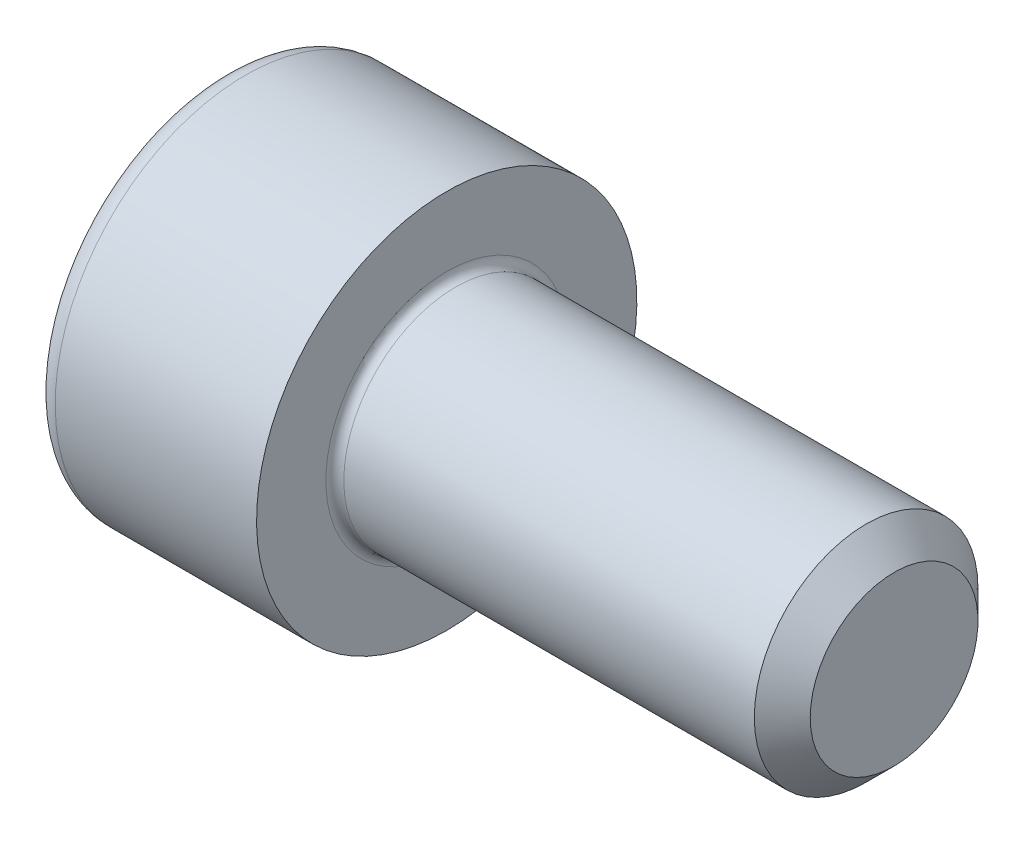
ISO-10303-21;
HEADER;
FILE_DESCRIPTION(('STEP AP214'),'2;1');
FILE_NAME('part.step','',(''),(''),'','','');
FILE_SCHEMA(('AUTOMOTIVE_DESIGN { 1 0 10303 214 1 1 1 1 }'));
ENDSEC;
DATA;
#1=APPLICATION_CONTEXT('core data for automotive mechanical design processes');
#2=APPLICATION_PROTOCOL_DEFINITION('international standard','automotive_design',2000,#1);
#3=PRODUCT_CONTEXT('',#1,'mechanical');
#4=PRODUCT('Part','Part','',(#3));
#5=PRODUCT_RELATED_PRODUCT_CATEGORY('part','',(#4));
#6=PRODUCT_DEFINITION_FORMATION('','',#4);
#7=PRODUCT_DEFINITION_CONTEXT('part definition',#1,'design');
#8=PRODUCT_DEFINITION('design','',#6,#7);
#9=PRODUCT_DEFINITION_SHAPE('','',#8);
#10=(LENGTH_UNIT() NAMED_UNIT(*) SI_UNIT(.MILLI.,.METRE.));
#11=(NAMED_UNIT(*) PLANE_ANGLE_UNIT() SI_UNIT($,.RADIAN.));
#12=(NAMED_UNIT(*) SI_UNIT($,.STERADIAN.) SOLID_ANGLE_UNIT());
#13=UNCERTAINTY_MEASURE_WITH_UNIT(LENGTH_MEASURE(1.E-05),#10,'distance_accuracy_value','');
#14=(GEOMETRIC_REPRESENTATION_CONTEXT(3) GLOBAL_UNCERTAINTY_ASSIGNED_CONTEXT((#13)) GLOBAL_UNIT_ASSIGNED_CONTEXT((#10,
#11,#12)) REPRESENTATION_CONTEXT('',''));
#15=CARTESIAN_POINT('',(0.,0.,0.));
#16=DIRECTION('',(0.,0.,1.));
#17=DIRECTION('',(1.,0.,0.));
#18=AXIS2_PLACEMENT_3D('',#15,#16,#17);
#19=CARTESIAN_POINT('',(-1.99999999995271,0.,0.));
#20=DIRECTION('',(-1.,0.,0.));
#21=DIRECTION('',(0.,0.,1.));
#22=AXIS2_PLACEMENT_3D('',#19,#20,#21);
#23=CONICAL_SURFACE('',#22,1.83319999985088,1.04719755109013);
#24=CARTESIAN_POINT('',(-0.941601486488253,-1.13686837721616E-10,0.));
#25=VERTEX_POINT('',#24);
#26=VERTEX_LOOP('',#25);
#27=FACE_BOUND('',#26,.T.);
#28=CARTESIAN_POINT('',(-2.00000000001834,0.,0.));
#29=DIRECTION('',(-1.,0.,0.));
#30=DIRECTION('',(0.,0.,1.));
#31=AXIS2_PLACEMENT_3D('',#28,#29,#30);
#32=CIRCLE('',#31,1.83319999996456);
#33=CARTESIAN_POINT('',(-2.00000000001834,-0.916599999982282,-1.58759777018694));
#34=VERTEX_POINT('',#33);
#35=CARTESIAN_POINT('',(-2.00000000001834,-1.83319999996456,0.));
#36=VERTEX_POINT('',#35);
#37=EDGE_CURVE('E88',#34,#36,#32,.T.);
#38=ORIENTED_EDGE('',*,*,#37,.T.);
#39=CARTESIAN_POINT('',(-2.00000000001834,0.,0.));
#40=DIRECTION('',(-1.,0.,0.));
#41=DIRECTION('',(0.,0.,1.));
#42=AXIS2_PLACEMENT_3D('',#39,#40,#41);
#43=CIRCLE('',#42,1.83319999996456);
#44=CARTESIAN_POINT('',(-2.00000000001834,-0.916599999982281,1.58759777018694));
#45=VERTEX_POINT('',#44);
#46=EDGE_CURVE('E83',#36,#45,#43,.T.);
#47=ORIENTED_EDGE('',*,*,#46,.T.);
#48=CARTESIAN_POINT('',(-2.00000000001834,0.,0.));
#49=DIRECTION('',(-1.,0.,0.));
#50=DIRECTION('',(0.,0.,1.));
#51=AXIS2_PLACEMENT_3D('',#48,#49,#50);
#52=CIRCLE('',#51,1.83319999996456);
#53=CARTESIAN_POINT('',(-1.99999999995271,0.916599999925436,1.58759777008849));
#54=VERTEX_POINT('',#53);
#55=EDGE_CURVE('E85',#45,#54,#52,.T.);
#56=ORIENTED_EDGE('',*,*,#55,.T.);
#57=CARTESIAN_POINT('',(-1.99999999995271,0.,0.));
#58=DIRECTION('',(-1.,0.,0.));
#59=DIRECTION('',(0.,0.,1.));
#60=AXIS2_PLACEMENT_3D('',#57,#58,#59);
#61=CIRCLE('',#60,1.83319999985088);
#62=CARTESIAN_POINT('',(-1.99999999995271,1.83319999985088,0.));
#63=VERTEX_POINT('',#62);
#64=EDGE_CURVE('E99',#54,#63,#61,.T.);
#65=ORIENTED_EDGE('',*,*,#64,.T.);
#66=CARTESIAN_POINT('',(-2.00000000001834,0.,0.));
#67=DIRECTION('',(-1.,0.,0.));
#68=DIRECTION('',(0.,0.,1.));
#69=AXIS2_PLACEMENT_3D('',#66,#67,#68);
#70=CIRCLE('',#69,1.83319999996456);
#71=CARTESIAN_POINT('',(-2.00000000001834,0.91659999998228,-1.58759777018694));
#72=VERTEX_POINT('',#71);
#73=EDGE_CURVE('E186',#63,#72,#70,.T.);
#74=ORIENTED_EDGE('',*,*,#73,.T.);
#75=CARTESIAN_POINT('',(-2.00000000001834,0.,0.));
#76=DIRECTION('',(-1.,0.,0.));
#77=DIRECTION('',(0.,0.,1.));
#78=AXIS2_PLACEMENT_3D('',#75,#76,#77);
#79=CIRCLE('',#78,1.83319999996456);
#80=EDGE_CURVE('E184',#72,#34,#79,.T.);
#81=ORIENTED_EDGE('',*,*,#80,.T.);
#82=EDGE_LOOP('',(#38,#47,#56,#65,#74,#81));
#83=FACE_BOUND('',#82,.T.);
#84=ADVANCED_FACE('F16',(#27,#83),#23,.F.);
#85=CARTESIAN_POINT('',(-2.,0.,0.));
#86=DIRECTION('',(-1.,0.,0.));
#87=DIRECTION('',(0.,-1.,0.));
#88=AXIS2_PLACEMENT_3D('',#85,#86,#87);
#89=PLANE('',#88);
#90=ORIENTED_EDGE('',*,*,#55,.F.);
#91=DIRECTION('',(0.,-1.,0.));
#92=VECTOR('',#91,1.);
#93=CARTESIAN_POINT('',(-2.,-0.9166,1.58759777021763));
#94=LINE('',#93,#92);
#95=EDGE_CURVE('E93',#45,#54,#94,.F.);
#96=ORIENTED_EDGE('',*,*,#95,.T.);
#97=EDGE_LOOP('',(#90,#96));
#98=FACE_BOUND('',#97,.T.);
#99=ADVANCED_FACE('F96',(#98),#89,.F.);
#100=CARTESIAN_POINT('',(-2.,0.,0.));
#101=DIRECTION('',(-1.,0.,0.));
#102=DIRECTION('',(0.,-1.,0.));
#103=AXIS2_PLACEMENT_3D('',#100,#101,#102);
#104=PLANE('',#103);
#105=ORIENTED_EDGE('',*,*,#64,.F.);
#106=DIRECTION('',(0.,-0.5,0.866025403784439));
#107=VECTOR('',#106,1.);
#108=CARTESIAN_POINT('',(-2.,0.9166,1.58759777021763));
#109=LINE('',#108,#107);
#110=EDGE_CURVE('E162',#54,#63,#109,.F.);
#111=ORIENTED_EDGE('',*,*,#110,.T.);
#112=EDGE_LOOP('',(#105,#111));
#113=FACE_BOUND('',#112,.T.);
#114=ADVANCED_FACE('F293',(#113),#104,.F.);
#115=CARTESIAN_POINT('',(-2.,0.,0.));
#116=DIRECTION('',(-1.,0.,0.));
#117=DIRECTION('',(0.,-1.,0.));
#118=AXIS2_PLACEMENT_3D('',#115,#116,#117);
#119=PLANE('',#118);
#120=ORIENTED_EDGE('',*,*,#73,.F.);
#121=DIRECTION('',(0.,0.5,0.866025403784439));
#122=VECTOR('',#121,1.);
#123=CARTESIAN_POINT('',(-2.,1.8332,0.));
#124=LINE('',#123,#122);
#125=EDGE_CURVE('E151',#63,#72,#124,.F.);
#126=ORIENTED_EDGE('',*,*,#125,.T.);
#127=EDGE_LOOP('',(#120,#126));
#128=FACE_BOUND('',#127,.T.);
#129=ADVANCED_FACE('F297',(#128),#119,.F.);
#130=CARTESIAN_POINT('',(-2.,0.,0.));
#131=DIRECTION('',(-1.,0.,0.));
#132=DIRECTION('',(0.,-1.,0.));
#133=AXIS2_PLACEMENT_3D('',#130,#131,#132);
#134=PLANE('',#133);
#135=ORIENTED_EDGE('',*,*,#80,.F.);
#136=DIRECTION('',(0.,1.,0.));
#137=VECTOR('',#136,1.);
#138=CARTESIAN_POINT('',(-2.,0.9166,-1.58759777021763));
#139=LINE('',#138,#137);
#140=EDGE_CURVE('E139',#72,#34,#139,.F.);
#141=ORIENTED_EDGE('',*,*,#140,.T.);
#142=EDGE_LOOP('',(#135,#141));
#143=FACE_BOUND('',#142,.T.);
#144=ADVANCED_FACE('F304',(#143),#134,.F.);
#145=CARTESIAN_POINT('',(-2.,0.,0.));
#146=DIRECTION('',(-1.,0.,0.));
#147=DIRECTION('',(0.,-1.,0.));
#148=AXIS2_PLACEMENT_3D('',#145,#146,#147);
#149=PLANE('',#148);
#150=ORIENTED_EDGE('',*,*,#37,.F.);
#151=DIRECTION('',(0.,0.5,-0.866025403784438));
#152=VECTOR('',#151,1.);
#153=CARTESIAN_POINT('',(-2.,-0.9166,-1.58759777021763));
#154=LINE('',#153,#152);
#155=EDGE_CURVE('E125',#34,#36,#154,.F.);
#156=ORIENTED_EDGE('',*,*,#155,.T.);
#157=EDGE_LOOP('',(#150,#156));
#158=FACE_BOUND('',#157,.T.);
#159=ADVANCED_FACE('F307',(#158),#149,.F.);
#160=CARTESIAN_POINT('',(-2.,0.,0.));
#161=DIRECTION('',(-1.,0.,0.));
#162=DIRECTION('',(0.,-1.,0.));
#163=AXIS2_PLACEMENT_3D('',#160,#161,#162);
#164=PLANE('',#163);
#165=ORIENTED_EDGE('',*,*,#46,.F.);
#166=DIRECTION('',(0.,-0.5,-0.866025403784438));
#167=VECTOR('',#166,1.);
#168=CARTESIAN_POINT('',(-2.,-1.8332,0.));
#169=LINE('',#168,#167);
#170=EDGE_CURVE('E101',#36,#45,#169,.F.);
#171=ORIENTED_EDGE('',*,*,#170,.T.);
#172=EDGE_LOOP('',(#165,#171));
#173=FACE_BOUND('',#172,.T.);
#174=ADVANCED_FACE('F102',(#173),#164,.F.);
#175=CARTESIAN_POINT('',(-2.,-0.9166,1.58759777021763));
#176=DIRECTION('',(0.,0.,1.));
#177=DIRECTION('',(0.,-1.,0.));
#178=AXIS2_PLACEMENT_3D('',#175,#176,#177);
#179=PLANE('',#178);
#180=DIRECTION('',(1.,0.,0.));
#181=VECTOR('',#180,1.);
#182=CARTESIAN_POINT('',(-2.,0.9166,1.58759777021763));
#183=LINE('',#182,#181);
#184=CARTESIAN_POINT('',(-4.,0.916599999999999,1.58759777021763));
#185=VERTEX_POINT('',#184);
#186=EDGE_CURVE('E113',#185,#54,#183,.T.);
#187=ORIENTED_EDGE('',*,*,#186,.T.);
#188=ORIENTED_EDGE('',*,*,#95,.F.);
#189=DIRECTION('',(1.,0.,0.));
#190=VECTOR('',#189,1.);
#191=CARTESIAN_POINT('',(-2.,-0.9166,1.58759777021763));
#192=LINE('',#191,#190);
#193=CARTESIAN_POINT('',(-4.,-0.9166,1.58759777021763));
#194=VERTEX_POINT('',#193);
#195=EDGE_CURVE('E106',#45,#194,#192,.F.);
#196=ORIENTED_EDGE('',*,*,#195,.T.);
#197=DIRECTION('',(0.,1.,0.));
#198=VECTOR('',#197,1.);
#199=CARTESIAN_POINT('',(-4.,1.8332,1.58759777021763));
#200=LINE('',#199,#198);
#201=EDGE_CURVE('E120',#194,#185,#200,.T.);
#202=ORIENTED_EDGE('',*,*,#201,.T.);
#203=EDGE_LOOP('',(#187,#188,#196,#202));
#204=FACE_BOUND('',#203,.T.);
#205=ADVANCED_FACE('F110',(#204),#179,.F.);
#206=CARTESIAN_POINT('',(-2.,0.9166,1.58759777021763));
#207=DIRECTION('',(0.,0.866025403784439,0.5));
#208=DIRECTION('',(0.,-0.5,0.866025403784439));
#209=AXIS2_PLACEMENT_3D('',#206,#207,#208);
#210=PLANE('',#209);
#211=DIRECTION('',(1.,0.,0.));
#212=VECTOR('',#211,1.);
#213=CARTESIAN_POINT('',(-2.,1.8332,0.));
#214=LINE('',#213,#212);
#215=CARTESIAN_POINT('',(-4.,1.8332,0.));
#216=VERTEX_POINT('',#215);
#217=EDGE_CURVE('E156',#216,#63,#214,.T.);
#218=ORIENTED_EDGE('',*,*,#217,.T.);
#219=ORIENTED_EDGE('',*,*,#110,.F.);
#220=ORIENTED_EDGE('',*,*,#186,.F.);
#221=DIRECTION('',(0.,0.500000000000001,-0.866025403784438));
#222=VECTOR('',#221,1.);
#223=CARTESIAN_POINT('',(-4.,0.9166,1.58759777021763));
#224=LINE('',#223,#222);
#225=EDGE_CURVE('E122',#185,#216,#224,.T.);
#226=ORIENTED_EDGE('',*,*,#225,.T.);
#227=EDGE_LOOP('',(#218,#219,#220,#226));
#228=FACE_BOUND('',#227,.T.);
#229=ADVANCED_FACE('F289',(#228),#210,.F.);
#230=CARTESIAN_POINT('',(-2.,1.8332,0.));
#231=DIRECTION('',(0.,0.866025403784439,-0.5));
#232=DIRECTION('',(0.,0.5,0.866025403784439));
#233=AXIS2_PLACEMENT_3D('',#230,#231,#232);
#234=PLANE('',#233);
#235=DIRECTION('',(1.,0.,0.));
#236=VECTOR('',#235,1.);
#237=CARTESIAN_POINT('',(-2.,0.9166,-1.58759777021763));
#238=LINE('',#237,#236);
#239=CARTESIAN_POINT('',(-4.,0.9166,-1.58759777021763));
#240=VERTEX_POINT('',#239);
#241=EDGE_CURVE('E144',#240,#72,#238,.T.);
#242=ORIENTED_EDGE('',*,*,#241,.T.);
#243=ORIENTED_EDGE('',*,*,#125,.F.);
#244=ORIENTED_EDGE('',*,*,#217,.F.);
#245=DIRECTION('',(0.,-0.499999999999999,-0.866025403784439));
#246=VECTOR('',#245,1.);
#247=CARTESIAN_POINT('',(-4.,1.8332,0.));
#248=LINE('',#247,#246);
#249=EDGE_CURVE('E146',#216,#240,#248,.T.);
#250=ORIENTED_EDGE('',*,*,#249,.T.);
#251=EDGE_LOOP('',(#242,#243,#244,#250));
#252=FACE_BOUND('',#251,.T.);
#253=ADVANCED_FACE('F300',(#252),#234,.F.);
#254=CARTESIAN_POINT('',(-2.,0.9166,-1.58759777021763));
#255=DIRECTION('',(0.,0.,-1.));
#256=DIRECTION('',(0.,1.,0.));
#257=AXIS2_PLACEMENT_3D('',#254,#255,#256);
#258=PLANE('',#257);
#259=DIRECTION('',(1.,0.,0.));
#260=VECTOR('',#259,1.);
#261=CARTESIAN_POINT('',(-2.,-0.9166,-1.58759777021763));
#262=LINE('',#261,#260);
#263=CARTESIAN_POINT('',(-4.,-0.9166,-1.58759777021763));
#264=VERTEX_POINT('',#263);
#265=EDGE_CURVE('E127',#264,#34,#262,.T.);
#266=ORIENTED_EDGE('',*,*,#265,.T.);
#267=ORIENTED_EDGE('',*,*,#140,.F.);
#268=ORIENTED_EDGE('',*,*,#241,.F.);
#269=DIRECTION('',(0.,1.,0.));
#270=VECTOR('',#269,1.);
#271=CARTESIAN_POINT('',(-4.,1.8332,-1.58759777021763));
#272=LINE('',#271,#270);
#273=EDGE_CURVE('E130',#240,#264,#272,.F.);
#274=ORIENTED_EDGE('',*,*,#273,.T.);
#275=EDGE_LOOP('',(#266,#267,#268,#274));
#276=FACE_BOUND('',#275,.T.);
#277=ADVANCED_FACE('F305',(#276),#258,.F.);
#278=CARTESIAN_POINT('',(-2.,-0.9166,-1.58759777021763));
#279=DIRECTION('',(0.,-0.866025403784438,-0.5));
#280=DIRECTION('',(0.,0.5,-0.866025403784438));
#281=AXIS2_PLACEMENT_3D('',#278,#279,#280);
#282=PLANE('',#281);
#283=DIRECTION('',(1.,0.,0.));
#284=VECTOR('',#283,1.);
#285=CARTESIAN_POINT('',(-2.,-1.8332,0.));
#286=LINE('',#285,#284);
#287=CARTESIAN_POINT('',(-4.,-1.8332,0.));
#288=VERTEX_POINT('',#287);
#289=EDGE_CURVE('E107',#288,#36,#286,.T.);
#290=ORIENTED_EDGE('',*,*,#289,.T.);
#291=ORIENTED_EDGE('',*,*,#155,.F.);
#292=ORIENTED_EDGE('',*,*,#265,.F.);
#293=DIRECTION('',(0.,-0.5,0.866025403784439));
#294=VECTOR('',#293,1.);
#295=CARTESIAN_POINT('',(-4.,-0.9166,-1.58759777021763));
#296=LINE('',#295,#294);
#297=EDGE_CURVE('E128',#264,#288,#296,.T.);
#298=ORIENTED_EDGE('',*,*,#297,.T.);
#299=EDGE_LOOP('',(#290,#291,#292,#298));
#300=FACE_BOUND('',#299,.T.);
#301=ADVANCED_FACE('F280',(#300),#282,.F.);
#302=CARTESIAN_POINT('',(-2.,-1.8332,0.));
#303=DIRECTION('',(0.,-0.866025403784438,0.5));
#304=DIRECTION('',(0.,-0.5,-0.866025403784438));
#305=AXIS2_PLACEMENT_3D('',#302,#303,#304);
#306=PLANE('',#305);
#307=ORIENTED_EDGE('',*,*,#195,.F.);
#308=ORIENTED_EDGE('',*,*,#170,.F.);
#309=ORIENTED_EDGE('',*,*,#289,.F.);
#310=DIRECTION('',(0.,0.5,0.866025403784439));
#311=VECTOR('',#310,1.);
#312=CARTESIAN_POINT('',(-4.,-1.8332,0.));
#313=LINE('',#312,#311);
#314=EDGE_CURVE('E118',#288,#194,#313,.T.);
#315=ORIENTED_EDGE('',*,*,#314,.T.);
#316=EDGE_LOOP('',(#307,#308,#309,#315));
#317=FACE_BOUND('',#316,.T.);
#318=ADVANCED_FACE('F116',(#317),#306,.F.);
#319=CARTESIAN_POINT('',(-4.,1.8332,0.));
#320=DIRECTION('',(1.,0.,0.));
#321=DIRECTION('',(0.,1.,0.));
#322=AXIS2_PLACEMENT_3D('',#319,#320,#321);
#323=PLANE('',#322);
#324=CARTESIAN_POINT('',(-4.,0.,0.));
#325=DIRECTION('',(1.,0.,0.));
#326=DIRECTION('',(0.,-1.,0.));
#327=AXIS2_PLACEMENT_3D('',#324,#325,#326);
#328=CIRCLE('',#327,3.);
#329=CARTESIAN_POINT('',(-4.,-3.,0.));
#330=VERTEX_POINT('',#329);
#331=CARTESIAN_POINT('',(-4.,3.,0.));
#332=VERTEX_POINT('',#331);
#333=EDGE_CURVE('E134',#330,#332,#328,.T.);
#334=ORIENTED_EDGE('',*,*,#333,.F.);
#335=CARTESIAN_POINT('',(-4.,0.,0.));
#336=DIRECTION('',(1.,0.,0.));
#337=DIRECTION('',(0.,1.,0.));
#338=AXIS2_PLACEMENT_3D('',#335,#336,#337);
#339=CIRCLE('',#338,3.);
#340=EDGE_CURVE('E249',#332,#330,#339,.T.);
#341=ORIENTED_EDGE('',*,*,#340,.F.);
#342=EDGE_LOOP('',(#334,#341));
#343=FACE_BOUND('',#342,.T.);
#344=ORIENTED_EDGE('',*,*,#297,.F.);
#345=ORIENTED_EDGE('',*,*,#273,.F.);
#346=ORIENTED_EDGE('',*,*,#249,.F.);
#347=ORIENTED_EDGE('',*,*,#225,.F.);
#348=ORIENTED_EDGE('',*,*,#201,.F.);
#349=ORIENTED_EDGE('',*,*,#314,.F.);
#350=EDGE_LOOP('',(#344,#345,#346,#347,#348,#349));
#351=FACE_BOUND('',#350,.T.);
#352=ADVANCED_FACE('F258',(#343,#351),#323,.F.);
#353=CARTESIAN_POINT('',(-3.6,0.,0.));
#354=DIRECTION('',(-1.,0.,0.));
#355=DIRECTION('',(0.,1.,0.));
#356=AXIS2_PLACEMENT_3D('',#353,#354,#355);
#357=TOROIDAL_SURFACE('',#356,3.,0.4);
#358=ORIENTED_EDGE('',*,*,#333,.T.);
#359=ORIENTED_EDGE('',*,*,#340,.T.);
#360=EDGE_LOOP('',(#358,#359));
#361=FACE_BOUND('',#360,.T.);
#362=CARTESIAN_POINT('',(-3.6,0.,0.));
#363=DIRECTION('',(-1.,0.,0.));
#364=DIRECTION('',(0.,-1.,0.));
#365=AXIS2_PLACEMENT_3D('',#362,#363,#364);
#366=CIRCLE('',#365,3.4);
#367=CARTESIAN_POINT('',(-3.6,-3.4,0.));
#368=VERTEX_POINT('',#367);
#369=EDGE_CURVE('E181',#368,#368,#366,.F.);
#370=ORIENTED_EDGE('',*,*,#369,.F.);
#371=EDGE_LOOP('',(#370));
#372=FACE_BOUND('',#371,.T.);
#373=ADVANCED_FACE('F253',(#361,#372),#357,.T.);
#374=CARTESIAN_POINT('',(-0.94160148652158,0.,0.));
#375=DIRECTION('',(-1.,0.,0.));
#376=DIRECTION('',(0.,-1.,0.));
#377=AXIS2_PLACEMENT_3D('',#374,#375,#376);
#378=CYLINDRICAL_SURFACE('',#377,3.4);
#379=ORIENTED_EDGE('',*,*,#369,.T.);
#380=EDGE_LOOP('',(#379));
#381=FACE_BOUND('',#380,.T.);
#382=CARTESIAN_POINT('',(0.,0.,0.));
#383=DIRECTION('',(-1.,0.,0.));
#384=DIRECTION('',(0.,-1.,0.));
#385=AXIS2_PLACEMENT_3D('',#382,#383,#384);
#386=CIRCLE('',#385,3.4);
#387=CARTESIAN_POINT('',(0.,-3.4,0.));
#388=VERTEX_POINT('',#387);
#389=EDGE_CURVE('E179',#388,#388,#386,.T.);
#390=ORIENTED_EDGE('',*,*,#389,.T.);
#391=EDGE_LOOP('',(#390));
#392=FACE_BOUND('',#391,.T.);
#393=ADVANCED_FACE('F257',(#381,#392),#378,.T.);
#394=CARTESIAN_POINT('',(8.,0.,0.));
#395=DIRECTION('',(-1.,0.,0.));
#396=DIRECTION('',(0.,0.,1.));
#397=AXIS2_PLACEMENT_3D('',#394,#395,#396);
#398=PLANE('',#397);
#399=CARTESIAN_POINT('',(8.0000000000382,0.,0.));
#400=DIRECTION('',(-1.,0.,0.));
#401=DIRECTION('',(0.,0.,1.));
#402=AXIS2_PLACEMENT_3D('',#399,#400,#401);
#403=CIRCLE('',#402,1.49999999990769);
#404=CARTESIAN_POINT('',(8.0000000000382,0.,1.49999999990769));
#405=VERTEX_POINT('',#404);
#406=EDGE_CURVE('E175',#405,#405,#403,.T.);
#407=ORIENTED_EDGE('',*,*,#406,.F.);
#408=EDGE_LOOP('',(#407));
#409=FACE_BOUND('',#408,.T.);
#410=ADVANCED_FACE('F226',(#409),#398,.F.);
#411=CARTESIAN_POINT('',(0.,3.4,0.));
#412=DIRECTION('',(-1.,0.,0.));
#413=DIRECTION('',(0.,-1.,0.));
#414=AXIS2_PLACEMENT_3D('',#411,#412,#413);
#415=PLANE('',#414);
#416=CARTESIAN_POINT('',(0.,0.,0.));
#417=DIRECTION('',(1.,0.,0.));
#418=DIRECTION('',(0.,-1.,0.));
#419=AXIS2_PLACEMENT_3D('',#416,#417,#418);
#420=CIRCLE('',#419,2.16);
#421=CARTESIAN_POINT('',(0.,2.16,0.));
#422=VERTEX_POINT('',#421);
#423=CARTESIAN_POINT('',(0.,-2.16,0.));
#424=VERTEX_POINT('',#423);
#425=EDGE_CURVE('E178',#422,#424,#420,.F.);
#426=ORIENTED_EDGE('',*,*,#425,.T.);
#427=CARTESIAN_POINT('',(0.,0.,0.));
#428=DIRECTION('',(1.,0.,0.));
#429=DIRECTION('',(0.,1.,0.));
#430=AXIS2_PLACEMENT_3D('',#427,#428,#429);
#431=CIRCLE('',#430,2.16);
#432=EDGE_CURVE('E35',#424,#422,#431,.F.);
#433=ORIENTED_EDGE('',*,*,#432,.T.);
#434=EDGE_LOOP('',(#426,#433));
#435=FACE_BOUND('',#434,.T.);
#436=ORIENTED_EDGE('',*,*,#389,.F.);
#437=EDGE_LOOP('',(#436));
#438=FACE_BOUND('',#437,.T.);
#439=ADVANCED_FACE('F217',(#435,#438),#415,.F.);
#440=CARTESIAN_POINT('',(7.49999999999318,0.,0.));
#441=DIRECTION('',(-1.,0.,0.));
#442=DIRECTION('',(0.,0.,1.));
#443=AXIS2_PLACEMENT_3D('',#440,#441,#442);
#444=CONICAL_SURFACE('',#443,1.99999999995271,0.785398163397448);
#445=ORIENTED_EDGE('',*,*,#406,.T.);
#446=EDGE_LOOP('',(#445));
#447=FACE_BOUND('',#446,.T.);
#448=CARTESIAN_POINT('',(7.5,0.,0.));
#449=DIRECTION('',(-1.,0.,0.));
#450=DIRECTION('',(0.,-1.,0.));
#451=AXIS2_PLACEMENT_3D('',#448,#449,#450);
#452=CIRCLE('',#451,2.);
#453=CARTESIAN_POINT('',(7.5,-2.,0.));
#454=VERTEX_POINT('',#453);
#455=EDGE_CURVE('E27',#454,#454,#452,.T.);
#456=ORIENTED_EDGE('',*,*,#455,.F.);
#457=EDGE_LOOP('',(#456));
#458=FACE_BOUND('',#457,.T.);
#459=ADVANCED_FACE('F206',(#447,#458),#444,.T.);
#460=CARTESIAN_POINT('',(0.16,0.,0.));
#461=DIRECTION('',(-1.,0.,0.));
#462=DIRECTION('',(0.,1.,0.));
#463=AXIS2_PLACEMENT_3D('',#460,#461,#462);
#464=TOROIDAL_SURFACE('',#463,2.16,0.16);
#465=CARTESIAN_POINT('',(0.16,0.,0.));
#466=DIRECTION('',(-1.,0.,0.));
#467=DIRECTION('',(0.,-1.,0.));
#468=AXIS2_PLACEMENT_3D('',#465,#466,#467);
#469=CIRCLE('',#468,2.);
#470=CARTESIAN_POINT('',(0.16,-2.,0.));
#471=VERTEX_POINT('',#470);
#472=EDGE_CURVE('E11',#471,#471,#469,.F.);
#473=ORIENTED_EDGE('',*,*,#472,.F.);
#474=EDGE_LOOP('',(#473));
#475=FACE_BOUND('',#474,.T.);
#476=ORIENTED_EDGE('',*,*,#425,.F.);
#477=ORIENTED_EDGE('',*,*,#432,.F.);
#478=EDGE_LOOP('',(#476,#477));
#479=FACE_BOUND('',#478,.T.);
#480=ADVANCED_FACE('F194',(#475,#479),#464,.F.);
#481=CARTESIAN_POINT('',(-0.94160148652158,0.,0.));
#482=DIRECTION('',(-1.,0.,0.));
#483=DIRECTION('',(0.,-1.,0.));
#484=AXIS2_PLACEMENT_3D('',#481,#482,#483);
#485=CYLINDRICAL_SURFACE('',#484,2.);
#486=ORIENTED_EDGE('',*,*,#472,.T.);
#487=EDGE_LOOP('',(#486));
#488=FACE_BOUND('',#487,.T.);
#489=ORIENTED_EDGE('',*,*,#455,.T.);
#490=EDGE_LOOP('',(#489));
#491=FACE_BOUND('',#490,.T.);
#492=ADVANCED_FACE('F205',(#488,#491),#485,.T.);
#493=CLOSED_SHELL('',(#84,#99,#114,#129,#144,#159,#174,#205,#229,#253,#277,#301,#318,#352,#373,
#393,#410,#439,#459,#480,#492));
#494=MANIFOLD_SOLID_BREP('B1',#493);
#495=ADVANCED_BREP_SHAPE_REPRESENTATION('',(#18,#494),#14);
#496=SHAPE_DEFINITION_REPRESENTATION(#9,#495);
ENDSEC;
END-ISO-10303-21;
